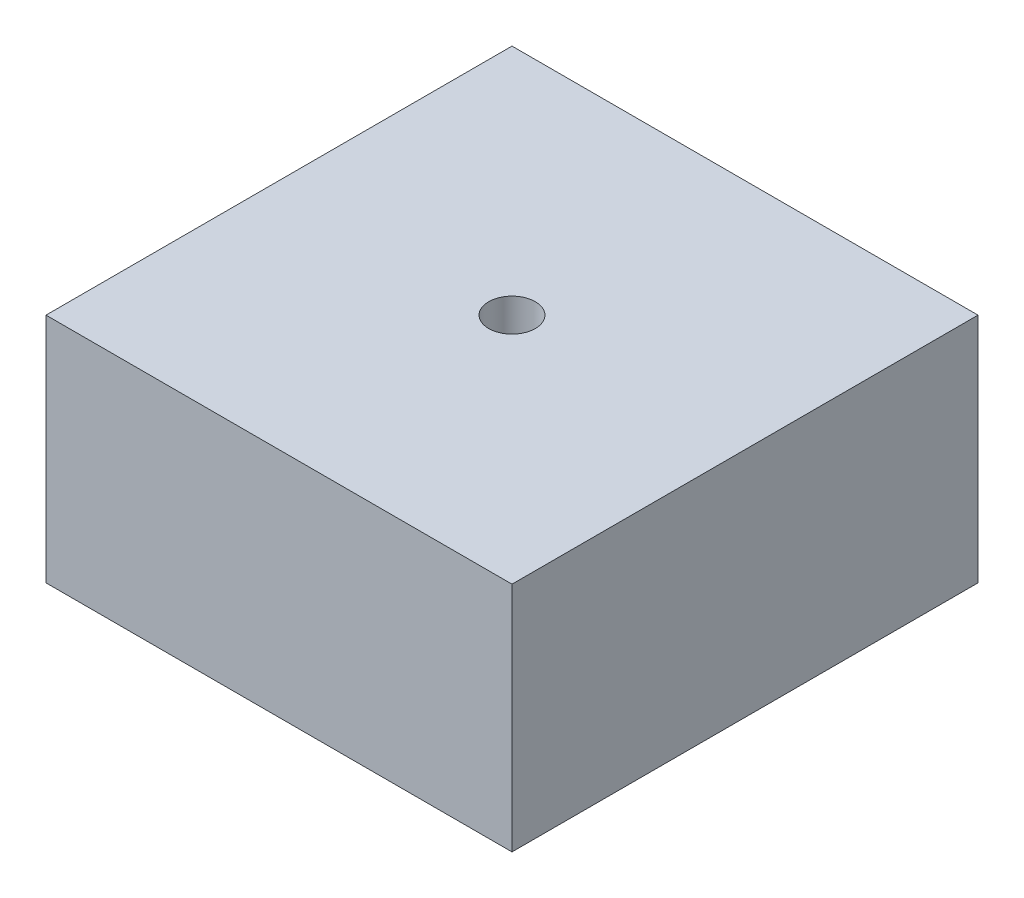
ISO-10303-21;
HEADER;
FILE_DESCRIPTION(('STEP AP214'),'2;1');
FILE_NAME('part.step','',(''),(''),'','','');
FILE_SCHEMA(('AUTOMOTIVE_DESIGN { 1 0 10303 214 1 1 1 1 }'));
ENDSEC;
DATA;
#1=APPLICATION_CONTEXT('core data for automotive mechanical design processes');
#2=APPLICATION_PROTOCOL_DEFINITION('international standard','automotive_design',2000,#1);
#3=PRODUCT_CONTEXT('',#1,'mechanical');
#4=PRODUCT('Part','Part','',(#3));
#5=PRODUCT_RELATED_PRODUCT_CATEGORY('part','',(#4));
#6=PRODUCT_DEFINITION_FORMATION('','',#4);
#7=PRODUCT_DEFINITION_CONTEXT('part definition',#1,'design');
#8=PRODUCT_DEFINITION('design','',#6,#7);
#9=PRODUCT_DEFINITION_SHAPE('','',#8);
#10=(LENGTH_UNIT() NAMED_UNIT(*) SI_UNIT(.MILLI.,.METRE.));
#11=(NAMED_UNIT(*) PLANE_ANGLE_UNIT() SI_UNIT($,.RADIAN.));
#12=(NAMED_UNIT(*) SI_UNIT($,.STERADIAN.) SOLID_ANGLE_UNIT());
#13=UNCERTAINTY_MEASURE_WITH_UNIT(LENGTH_MEASURE(1.E-05),#10,'distance_accuracy_value','');
#14=(GEOMETRIC_REPRESENTATION_CONTEXT(3) GLOBAL_UNCERTAINTY_ASSIGNED_CONTEXT((#13)) GLOBAL_UNIT_ASSIGNED_CONTEXT((#10,
#11,#12)) REPRESENTATION_CONTEXT('',''));
#15=CARTESIAN_POINT('',(0.,0.,0.));
#16=DIRECTION('',(0.,0.,1.));
#17=DIRECTION('',(1.,0.,0.));
#18=AXIS2_PLACEMENT_3D('',#15,#16,#17);
#19=CARTESIAN_POINT('',(50.,49.7625,50.));
#20=DIRECTION('',(-1.,0.,0.));
#21=DIRECTION('',(0.,0.,1.));
#22=AXIS2_PLACEMENT_3D('',#19,#20,#21);
#23=PLANE('',#22);
#24=DIRECTION('',(0.,0.,-1.));
#25=VECTOR('',#24,1.);
#26=CARTESIAN_POINT('',(50.,0.,50.));
#27=LINE('',#26,#25);
#28=CARTESIAN_POINT('',(50.,0.,50.));
#29=VERTEX_POINT('',#28);
#30=CARTESIAN_POINT('',(50.,0.,-50.));
#31=VERTEX_POINT('',#30);
#32=EDGE_CURVE('E95',#29,#31,#27,.T.);
#33=ORIENTED_EDGE('',*,*,#32,.T.);
#34=DIRECTION('',(0.,-1.,0.));
#35=VECTOR('',#34,1.);
#36=CARTESIAN_POINT('',(50.,49.7625,-50.));
#37=LINE('',#36,#35);
#38=CARTESIAN_POINT('',(50.,49.7625,-50.));
#39=VERTEX_POINT('',#38);
#40=EDGE_CURVE('E11',#39,#31,#37,.T.);
#41=ORIENTED_EDGE('',*,*,#40,.F.);
#42=DIRECTION('',(0.,0.,-1.));
#43=VECTOR('',#42,1.);
#44=CARTESIAN_POINT('',(50.,49.7625,50.));
#45=LINE('',#44,#43);
#46=CARTESIAN_POINT('',(50.,49.7625,50.));
#47=VERTEX_POINT('',#46);
#48=EDGE_CURVE('E83',#47,#39,#45,.T.);
#49=ORIENTED_EDGE('',*,*,#48,.F.);
#50=DIRECTION('',(0.,-1.,0.));
#51=VECTOR('',#50,1.);
#52=CARTESIAN_POINT('',(50.,49.7625,50.));
#53=LINE('',#52,#51);
#54=EDGE_CURVE('E91',#47,#29,#53,.T.);
#55=ORIENTED_EDGE('',*,*,#54,.T.);
#56=EDGE_LOOP('',(#33,#41,#49,#55));
#57=FACE_BOUND('',#56,.T.);
#58=ADVANCED_FACE('F32',(#57),#23,.F.);
#59=CARTESIAN_POINT('',(-50.,49.7625,-50.));
#60=DIRECTION('',(0.,0.,1.));
#61=DIRECTION('',(1.,0.,0.));
#62=AXIS2_PLACEMENT_3D('',#59,#60,#61);
#63=PLANE('',#62);
#64=DIRECTION('',(-1.,0.,0.));
#65=VECTOR('',#64,1.);
#66=CARTESIAN_POINT('',(-50.,0.,-50.));
#67=LINE('',#66,#65);
#68=CARTESIAN_POINT('',(-50.,0.,-50.));
#69=VERTEX_POINT('',#68);
#70=EDGE_CURVE('E87',#31,#69,#67,.T.);
#71=ORIENTED_EDGE('',*,*,#70,.T.);
#72=DIRECTION('',(0.,-1.,0.));
#73=VECTOR('',#72,1.);
#74=CARTESIAN_POINT('',(-50.,49.7625,-50.));
#75=LINE('',#74,#73);
#76=CARTESIAN_POINT('',(-50.,49.7625,-50.));
#77=VERTEX_POINT('',#76);
#78=EDGE_CURVE('E40',#77,#69,#75,.T.);
#79=ORIENTED_EDGE('',*,*,#78,.F.);
#80=DIRECTION('',(-1.,0.,0.));
#81=VECTOR('',#80,1.);
#82=CARTESIAN_POINT('',(-50.,49.7625,-50.));
#83=LINE('',#82,#81);
#84=EDGE_CURVE('E78',#39,#77,#83,.T.);
#85=ORIENTED_EDGE('',*,*,#84,.F.);
#86=ORIENTED_EDGE('',*,*,#40,.T.);
#87=EDGE_LOOP('',(#71,#79,#85,#86));
#88=FACE_BOUND('',#87,.T.);
#89=ADVANCED_FACE('F86',(#88),#63,.F.);
#90=CARTESIAN_POINT('',(-50.,49.7625,50.));
#91=DIRECTION('',(1.,0.,0.));
#92=DIRECTION('',(0.,0.,-1.));
#93=AXIS2_PLACEMENT_3D('',#90,#91,#92);
#94=PLANE('',#93);
#95=DIRECTION('',(0.,0.,1.));
#96=VECTOR('',#95,1.);
#97=CARTESIAN_POINT('',(-50.,0.,50.));
#98=LINE('',#97,#96);
#99=CARTESIAN_POINT('',(-50.,0.,50.));
#100=VERTEX_POINT('',#99);
#101=EDGE_CURVE('E65',#69,#100,#98,.T.);
#102=ORIENTED_EDGE('',*,*,#101,.T.);
#103=DIRECTION('',(0.,-1.,0.));
#104=VECTOR('',#103,1.);
#105=CARTESIAN_POINT('',(-50.,49.7625,50.));
#106=LINE('',#105,#104);
#107=CARTESIAN_POINT('',(-50.,49.7625,50.));
#108=VERTEX_POINT('',#107);
#109=EDGE_CURVE('E88',#108,#100,#106,.T.);
#110=ORIENTED_EDGE('',*,*,#109,.F.);
#111=DIRECTION('',(0.,0.,1.));
#112=VECTOR('',#111,1.);
#113=CARTESIAN_POINT('',(-50.,49.7625,50.));
#114=LINE('',#113,#112);
#115=EDGE_CURVE('E81',#77,#108,#114,.T.);
#116=ORIENTED_EDGE('',*,*,#115,.F.);
#117=ORIENTED_EDGE('',*,*,#78,.T.);
#118=EDGE_LOOP('',(#102,#110,#116,#117));
#119=FACE_BOUND('',#118,.T.);
#120=ADVANCED_FACE('F89',(#119),#94,.F.);
#121=CARTESIAN_POINT('',(-50.,49.7625,50.));
#122=DIRECTION('',(0.,0.,-1.));
#123=DIRECTION('',(-1.,0.,0.));
#124=AXIS2_PLACEMENT_3D('',#121,#122,#123);
#125=PLANE('',#124);
#126=DIRECTION('',(1.,0.,0.));
#127=VECTOR('',#126,1.);
#128=CARTESIAN_POINT('',(-50.,0.,50.));
#129=LINE('',#128,#127);
#130=EDGE_CURVE('E71',#100,#29,#129,.T.);
#131=ORIENTED_EDGE('',*,*,#130,.T.);
#132=ORIENTED_EDGE('',*,*,#54,.F.);
#133=DIRECTION('',(1.,0.,0.));
#134=VECTOR('',#133,1.);
#135=CARTESIAN_POINT('',(-50.,49.7625,50.));
#136=LINE('',#135,#134);
#137=EDGE_CURVE('E48',#108,#47,#136,.T.);
#138=ORIENTED_EDGE('',*,*,#137,.F.);
#139=ORIENTED_EDGE('',*,*,#109,.T.);
#140=EDGE_LOOP('',(#131,#132,#138,#139));
#141=FACE_BOUND('',#140,.T.);
#142=ADVANCED_FACE('F103',(#141),#125,.F.);
#143=CARTESIAN_POINT('',(50.,49.7625,-50.));
#144=DIRECTION('',(0.,-1.,0.));
#145=DIRECTION('',(0.,0.,-1.));
#146=AXIS2_PLACEMENT_3D('',#143,#144,#145);
#147=PLANE('',#146);
#148=CARTESIAN_POINT('',(0.,49.7625,0.));
#149=DIRECTION('',(0.,1.,0.));
#150=DIRECTION('',(0.,0.,1.));
#151=AXIS2_PLACEMENT_3D('',#148,#149,#150);
#152=CIRCLE('',#151,5.);
#153=CARTESIAN_POINT('',(0.,49.7625,5.));
#154=VERTEX_POINT('',#153);
#155=EDGE_CURVE('E109',#154,#154,#152,.T.);
#156=ORIENTED_EDGE('',*,*,#155,.F.);
#157=EDGE_LOOP('',(#156));
#158=FACE_BOUND('',#157,.T.);
#159=ORIENTED_EDGE('',*,*,#48,.T.);
#160=ORIENTED_EDGE('',*,*,#84,.T.);
#161=ORIENTED_EDGE('',*,*,#115,.T.);
#162=ORIENTED_EDGE('',*,*,#137,.T.);
#163=EDGE_LOOP('',(#159,#160,#161,#162));
#164=FACE_BOUND('',#163,.T.);
#165=ADVANCED_FACE('F79',(#158,#164),#147,.F.);
#166=CARTESIAN_POINT('',(50.,0.,-50.));
#167=DIRECTION('',(0.,-1.,0.));
#168=DIRECTION('',(0.,0.,-1.));
#169=AXIS2_PLACEMENT_3D('',#166,#167,#168);
#170=PLANE('',#169);
#171=CARTESIAN_POINT('',(0.,0.,0.));
#172=DIRECTION('',(0.,1.,0.));
#173=DIRECTION('',(0.,0.,1.));
#174=AXIS2_PLACEMENT_3D('',#171,#172,#173);
#175=CIRCLE('',#174,5.);
#176=CARTESIAN_POINT('',(0.,0.,5.));
#177=VERTEX_POINT('',#176);
#178=EDGE_CURVE('E98',#177,#177,#175,.T.);
#179=ORIENTED_EDGE('',*,*,#178,.T.);
#180=EDGE_LOOP('',(#179));
#181=FACE_BOUND('',#180,.T.);
#182=ORIENTED_EDGE('',*,*,#32,.F.);
#183=ORIENTED_EDGE('',*,*,#130,.F.);
#184=ORIENTED_EDGE('',*,*,#101,.F.);
#185=ORIENTED_EDGE('',*,*,#70,.F.);
#186=EDGE_LOOP('',(#182,#183,#184,#185));
#187=FACE_BOUND('',#186,.T.);
#188=ADVANCED_FACE('F106',(#181,#187),#170,.T.);
#189=CARTESIAN_POINT('',(0.,0.,0.));
#190=DIRECTION('',(0.,1.,0.));
#191=DIRECTION('',(0.,0.,1.));
#192=AXIS2_PLACEMENT_3D('',#189,#190,#191);
#193=CYLINDRICAL_SURFACE('',#192,5.);
#194=ORIENTED_EDGE('',*,*,#178,.F.);
#195=EDGE_LOOP('',(#194));
#196=FACE_BOUND('',#195,.T.);
#197=ORIENTED_EDGE('',*,*,#155,.T.);
#198=EDGE_LOOP('',(#197));
#199=FACE_BOUND('',#198,.T.);
#200=ADVANCED_FACE('F116',(#196,#199),#193,.F.);
#201=CLOSED_SHELL('',(#58,#89,#120,#142,#165,#188,#200));
#202=MANIFOLD_SOLID_BREP('B2',#201);
#203=ADVANCED_BREP_SHAPE_REPRESENTATION('',(#18,#202),#14);
#204=SHAPE_DEFINITION_REPRESENTATION(#9,#203);
ENDSEC;
END-ISO-10303-21;
